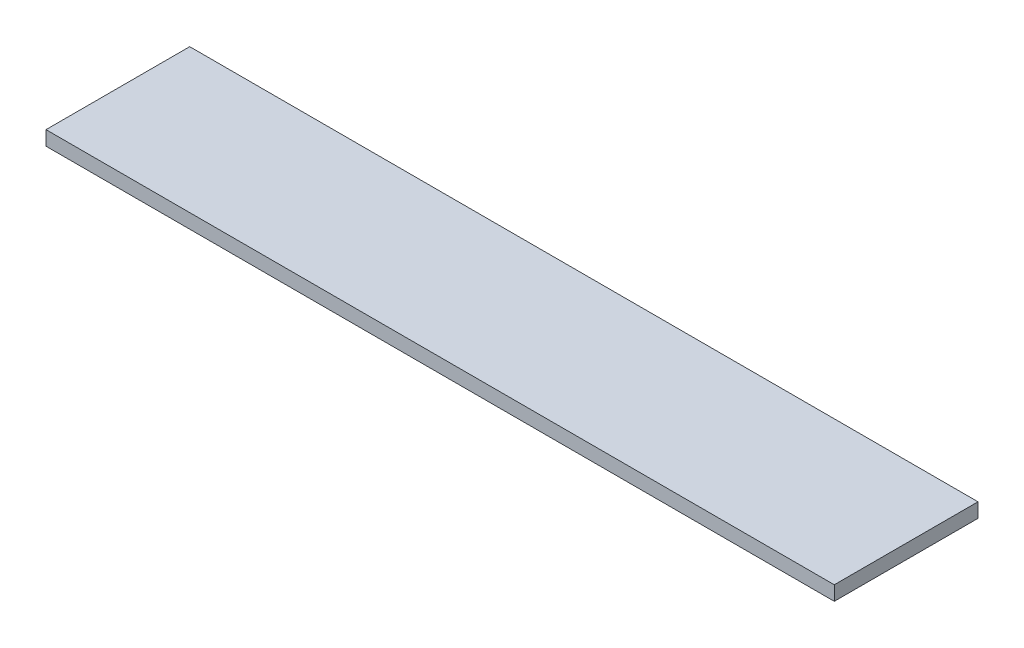
ISO-10303-21;
HEADER;
FILE_DESCRIPTION(('STEP AP214'),'2;1');
FILE_NAME('part.step','',(''),(''),'','','');
FILE_SCHEMA(('AUTOMOTIVE_DESIGN { 1 0 10303 214 1 1 1 1 }'));
ENDSEC;
DATA;
#1=APPLICATION_CONTEXT('core data for automotive mechanical design processes');
#2=APPLICATION_PROTOCOL_DEFINITION('international standard','automotive_design',2000,#1);
#3=PRODUCT_CONTEXT('',#1,'mechanical');
#4=PRODUCT('Part','Part','',(#3));
#5=PRODUCT_RELATED_PRODUCT_CATEGORY('part','',(#4));
#6=PRODUCT_DEFINITION_FORMATION('','',#4);
#7=PRODUCT_DEFINITION_CONTEXT('part definition',#1,'design');
#8=PRODUCT_DEFINITION('design','',#6,#7);
#9=PRODUCT_DEFINITION_SHAPE('','',#8);
#10=(LENGTH_UNIT() NAMED_UNIT(*) SI_UNIT(.MILLI.,.METRE.));
#11=(NAMED_UNIT(*) PLANE_ANGLE_UNIT() SI_UNIT($,.RADIAN.));
#12=(NAMED_UNIT(*) SI_UNIT($,.STERADIAN.) SOLID_ANGLE_UNIT());
#13=UNCERTAINTY_MEASURE_WITH_UNIT(LENGTH_MEASURE(1.E-05),#10,'distance_accuracy_value','');
#14=(GEOMETRIC_REPRESENTATION_CONTEXT(3) GLOBAL_UNCERTAINTY_ASSIGNED_CONTEXT((#13)) GLOBAL_UNIT_ASSIGNED_CONTEXT((#10,
#11,#12)) REPRESENTATION_CONTEXT('',''));
#15=CARTESIAN_POINT('',(0.,0.,0.));
#16=DIRECTION('',(0.,0.,1.));
#17=DIRECTION('',(1.,0.,0.));
#18=AXIS2_PLACEMENT_3D('',#15,#16,#17);
#19=CARTESIAN_POINT('',(-274.265,10.,-50.));
#20=DIRECTION('',(1.,0.,0.));
#21=DIRECTION('',(0.,0.,-1.));
#22=AXIS2_PLACEMENT_3D('',#19,#20,#21);
#23=PLANE('',#22);
#24=DIRECTION('',(0.,0.,1.));
#25=VECTOR('',#24,1.);
#26=CARTESIAN_POINT('',(-274.265,0.,-50.));
#27=LINE('',#26,#25);
#28=CARTESIAN_POINT('',(-274.265,0.,-50.));
#29=VERTEX_POINT('',#28);
#30=CARTESIAN_POINT('',(-274.265,0.,50.));
#31=VERTEX_POINT('',#30);
#32=EDGE_CURVE('E97',#29,#31,#27,.T.);
#33=ORIENTED_EDGE('',*,*,#32,.T.);
#34=DIRECTION('',(0.,-1.,0.));
#35=VECTOR('',#34,1.);
#36=CARTESIAN_POINT('',(-274.265,10.,50.));
#37=LINE('',#36,#35);
#38=CARTESIAN_POINT('',(-274.265,10.,50.));
#39=VERTEX_POINT('',#38);
#40=EDGE_CURVE('E11',#39,#31,#37,.T.);
#41=ORIENTED_EDGE('',*,*,#40,.F.);
#42=DIRECTION('',(0.,0.,1.));
#43=VECTOR('',#42,1.);
#44=CARTESIAN_POINT('',(-274.265,10.,-50.));
#45=LINE('',#44,#43);
#46=CARTESIAN_POINT('',(-274.265,10.,-50.));
#47=VERTEX_POINT('',#46);
#48=EDGE_CURVE('E85',#47,#39,#45,.T.);
#49=ORIENTED_EDGE('',*,*,#48,.F.);
#50=DIRECTION('',(0.,-1.,0.));
#51=VECTOR('',#50,1.);
#52=CARTESIAN_POINT('',(-274.265,10.,-50.));
#53=LINE('',#52,#51);
#54=EDGE_CURVE('E93',#47,#29,#53,.T.);
#55=ORIENTED_EDGE('',*,*,#54,.T.);
#56=EDGE_LOOP('',(#33,#41,#49,#55));
#57=FACE_BOUND('',#56,.T.);
#58=ADVANCED_FACE('F34',(#57),#23,.F.);
#59=CARTESIAN_POINT('',(-274.265,10.,50.));
#60=DIRECTION('',(0.,0.,-1.));
#61=DIRECTION('',(-1.,0.,0.));
#62=AXIS2_PLACEMENT_3D('',#59,#60,#61);
#63=PLANE('',#62);
#64=DIRECTION('',(1.,0.,0.));
#65=VECTOR('',#64,1.);
#66=CARTESIAN_POINT('',(-274.265,0.,50.));
#67=LINE('',#66,#65);
#68=CARTESIAN_POINT('',(274.265,0.,50.));
#69=VERTEX_POINT('',#68);
#70=EDGE_CURVE('E89',#31,#69,#67,.T.);
#71=ORIENTED_EDGE('',*,*,#70,.T.);
#72=DIRECTION('',(0.,-1.,0.));
#73=VECTOR('',#72,1.);
#74=CARTESIAN_POINT('',(274.265,10.,50.));
#75=LINE('',#74,#73);
#76=CARTESIAN_POINT('',(274.265,10.,50.));
#77=VERTEX_POINT('',#76);
#78=EDGE_CURVE('E42',#77,#69,#75,.T.);
#79=ORIENTED_EDGE('',*,*,#78,.F.);
#80=DIRECTION('',(1.,0.,0.));
#81=VECTOR('',#80,1.);
#82=CARTESIAN_POINT('',(-274.265,10.,50.));
#83=LINE('',#82,#81);
#84=EDGE_CURVE('E80',#39,#77,#83,.T.);
#85=ORIENTED_EDGE('',*,*,#84,.F.);
#86=ORIENTED_EDGE('',*,*,#40,.T.);
#87=EDGE_LOOP('',(#71,#79,#85,#86));
#88=FACE_BOUND('',#87,.T.);
#89=ADVANCED_FACE('F88',(#88),#63,.F.);
#90=CARTESIAN_POINT('',(274.265,10.,-50.));
#91=DIRECTION('',(-1.,0.,0.));
#92=DIRECTION('',(0.,0.,1.));
#93=AXIS2_PLACEMENT_3D('',#90,#91,#92);
#94=PLANE('',#93);
#95=DIRECTION('',(0.,0.,-1.));
#96=VECTOR('',#95,1.);
#97=CARTESIAN_POINT('',(274.265,0.,-50.));
#98=LINE('',#97,#96);
#99=CARTESIAN_POINT('',(274.265,0.,-50.));
#100=VERTEX_POINT('',#99);
#101=EDGE_CURVE('E67',#69,#100,#98,.T.);
#102=ORIENTED_EDGE('',*,*,#101,.T.);
#103=DIRECTION('',(0.,-1.,0.));
#104=VECTOR('',#103,1.);
#105=CARTESIAN_POINT('',(274.265,10.,-50.));
#106=LINE('',#105,#104);
#107=CARTESIAN_POINT('',(274.265,10.,-50.));
#108=VERTEX_POINT('',#107);
#109=EDGE_CURVE('E90',#108,#100,#106,.T.);
#110=ORIENTED_EDGE('',*,*,#109,.F.);
#111=DIRECTION('',(0.,0.,-1.));
#112=VECTOR('',#111,1.);
#113=CARTESIAN_POINT('',(274.265,10.,-50.));
#114=LINE('',#113,#112);
#115=EDGE_CURVE('E83',#77,#108,#114,.T.);
#116=ORIENTED_EDGE('',*,*,#115,.F.);
#117=ORIENTED_EDGE('',*,*,#78,.T.);
#118=EDGE_LOOP('',(#102,#110,#116,#117));
#119=FACE_BOUND('',#118,.T.);
#120=ADVANCED_FACE('F91',(#119),#94,.F.);
#121=CARTESIAN_POINT('',(-274.265,10.,-50.));
#122=DIRECTION('',(0.,0.,1.));
#123=DIRECTION('',(1.,0.,0.));
#124=AXIS2_PLACEMENT_3D('',#121,#122,#123);
#125=PLANE('',#124);
#126=DIRECTION('',(-1.,0.,0.));
#127=VECTOR('',#126,1.);
#128=CARTESIAN_POINT('',(-274.265,0.,-50.));
#129=LINE('',#128,#127);
#130=EDGE_CURVE('E73',#100,#29,#129,.T.);
#131=ORIENTED_EDGE('',*,*,#130,.T.);
#132=ORIENTED_EDGE('',*,*,#54,.F.);
#133=DIRECTION('',(-1.,0.,0.));
#134=VECTOR('',#133,1.);
#135=CARTESIAN_POINT('',(-274.265,10.,-50.));
#136=LINE('',#135,#134);
#137=EDGE_CURVE('E50',#108,#47,#136,.T.);
#138=ORIENTED_EDGE('',*,*,#137,.F.);
#139=ORIENTED_EDGE('',*,*,#109,.T.);
#140=EDGE_LOOP('',(#131,#132,#138,#139));
#141=FACE_BOUND('',#140,.T.);
#142=ADVANCED_FACE('F104',(#141),#125,.F.);
#143=CARTESIAN_POINT('',(0.,10.,0.));
#144=DIRECTION('',(0.,1.,0.));
#145=DIRECTION('',(0.,0.,1.));
#146=AXIS2_PLACEMENT_3D('',#143,#144,#145);
#147=PLANE('',#146);
#148=ORIENTED_EDGE('',*,*,#48,.T.);
#149=ORIENTED_EDGE('',*,*,#84,.T.);
#150=ORIENTED_EDGE('',*,*,#115,.T.);
#151=ORIENTED_EDGE('',*,*,#137,.T.);
#152=EDGE_LOOP('',(#148,#149,#150,#151));
#153=FACE_BOUND('',#152,.T.);
#154=ADVANCED_FACE('F81',(#153),#147,.T.);
#155=CARTESIAN_POINT('',(0.,0.,0.));
#156=DIRECTION('',(0.,1.,0.));
#157=DIRECTION('',(0.,0.,1.));
#158=AXIS2_PLACEMENT_3D('',#155,#156,#157);
#159=PLANE('',#158);
#160=ORIENTED_EDGE('',*,*,#32,.F.);
#161=ORIENTED_EDGE('',*,*,#130,.F.);
#162=ORIENTED_EDGE('',*,*,#101,.F.);
#163=ORIENTED_EDGE('',*,*,#70,.F.);
#164=EDGE_LOOP('',(#160,#161,#162,#163));
#165=FACE_BOUND('',#164,.T.);
#166=ADVANCED_FACE('F107',(#165),#159,.F.);
#167=CLOSED_SHELL('',(#58,#89,#120,#142,#154,#166));
#168=MANIFOLD_SOLID_BREP('B2',#167);
#169=ADVANCED_BREP_SHAPE_REPRESENTATION('',(#18,#168),#14);
#170=SHAPE_DEFINITION_REPRESENTATION(#9,#169);
ENDSEC;
END-ISO-10303-21;
